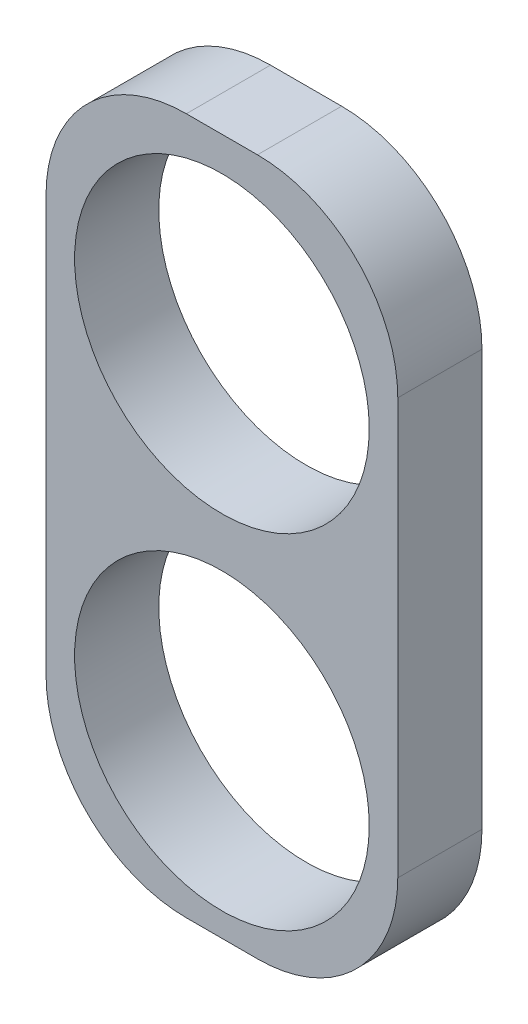
ISO-10303-21;
HEADER;
FILE_DESCRIPTION(('STEP AP214'),'2;1');
FILE_NAME('part.step','',(''),(''),'','','');
FILE_SCHEMA(('AUTOMOTIVE_DESIGN { 1 0 10303 214 1 1 1 1 }'));
ENDSEC;
DATA;
#1=APPLICATION_CONTEXT('core data for automotive mechanical design processes');
#2=APPLICATION_PROTOCOL_DEFINITION('international standard','automotive_design',2000,#1);
#3=PRODUCT_CONTEXT('',#1,'mechanical');
#4=PRODUCT('Part','Part','',(#3));
#5=PRODUCT_RELATED_PRODUCT_CATEGORY('part','',(#4));
#6=PRODUCT_DEFINITION_FORMATION('','',#4);
#7=PRODUCT_DEFINITION_CONTEXT('part definition',#1,'design');
#8=PRODUCT_DEFINITION('design','',#6,#7);
#9=PRODUCT_DEFINITION_SHAPE('','',#8);
#10=(LENGTH_UNIT() NAMED_UNIT(*) SI_UNIT(.MILLI.,.METRE.));
#11=(NAMED_UNIT(*) PLANE_ANGLE_UNIT() SI_UNIT($,.RADIAN.));
#12=(NAMED_UNIT(*) SI_UNIT($,.STERADIAN.) SOLID_ANGLE_UNIT());
#13=UNCERTAINTY_MEASURE_WITH_UNIT(LENGTH_MEASURE(1.E-05),#10,'distance_accuracy_value','');
#14=(GEOMETRIC_REPRESENTATION_CONTEXT(3) GLOBAL_UNCERTAINTY_ASSIGNED_CONTEXT((#13)) GLOBAL_UNIT_ASSIGNED_CONTEXT((#10,
#11,#12)) REPRESENTATION_CONTEXT('',''));
#15=CARTESIAN_POINT('',(0.,0.,0.));
#16=DIRECTION('',(0.,0.,1.));
#17=DIRECTION('',(1.,0.,0.));
#18=AXIS2_PLACEMENT_3D('',#15,#16,#17);
#19=CARTESIAN_POINT('',(0.,0.,1.2));
#20=DIRECTION('',(0.,0.,-1.));
#21=DIRECTION('',(-1.,0.,0.));
#22=AXIS2_PLACEMENT_3D('',#19,#20,#21);
#23=PLANE('',#22);
#24=DIRECTION('',(1.,0.,0.));
#25=VECTOR('',#24,1.);
#26=CARTESIAN_POINT('',(-2.50689281618218,-4.96326867727692,1.2));
#27=LINE('',#26,#25);
#28=CARTESIAN_POINT('',(-0.506892816182179,-4.96326867727692,1.2));
#29=VERTEX_POINT('',#28);
#30=CARTESIAN_POINT('',(0.50689281618218,-4.96326867727692,1.2));
#31=VERTEX_POINT('',#30);
#32=EDGE_CURVE('E139',#29,#31,#27,.T.);
#33=ORIENTED_EDGE('',*,*,#32,.T.);
#34=CARTESIAN_POINT('',(0.50689281618218,-2.96326867727692,1.2));
#35=DIRECTION('',(0.,0.,-1.));
#36=DIRECTION('',(-1.,0.,0.));
#37=AXIS2_PLACEMENT_3D('',#34,#35,#36);
#38=CIRCLE('',#37,2.);
#39=CARTESIAN_POINT('',(2.50689281618218,-2.96326867727692,1.2));
#40=VERTEX_POINT('',#39);
#41=EDGE_CURVE('E158',#31,#40,#38,.F.);
#42=ORIENTED_EDGE('',*,*,#41,.T.);
#43=DIRECTION('',(0.,1.,0.));
#44=VECTOR('',#43,1.);
#45=CARTESIAN_POINT('',(2.50689281618218,-4.96326867727692,1.2));
#46=LINE('',#45,#44);
#47=CARTESIAN_POINT('',(2.50689281618218,2.96326867727692,1.2));
#48=VERTEX_POINT('',#47);
#49=EDGE_CURVE('E122',#40,#48,#46,.T.);
#50=ORIENTED_EDGE('',*,*,#49,.T.);
#51=CARTESIAN_POINT('',(0.506892816182179,2.96326867727692,1.2));
#52=DIRECTION('',(0.,0.,-1.));
#53=DIRECTION('',(-1.,0.,0.));
#54=AXIS2_PLACEMENT_3D('',#51,#52,#53);
#55=CIRCLE('',#54,2.);
#56=CARTESIAN_POINT('',(0.506892816182179,4.96326867727692,1.2));
#57=VERTEX_POINT('',#56);
#58=EDGE_CURVE('E153',#48,#57,#55,.F.);
#59=ORIENTED_EDGE('',*,*,#58,.T.);
#60=DIRECTION('',(-1.,0.,0.));
#61=VECTOR('',#60,1.);
#62=CARTESIAN_POINT('',(-2.50689281618218,4.96326867727692,1.2));
#63=LINE('',#62,#61);
#64=CARTESIAN_POINT('',(-0.506892816182179,4.96326867727692,1.2));
#65=VERTEX_POINT('',#64);
#66=EDGE_CURVE('E169',#57,#65,#63,.T.);
#67=ORIENTED_EDGE('',*,*,#66,.T.);
#68=CARTESIAN_POINT('',(-0.506892816182179,2.96326867727692,1.2));
#69=DIRECTION('',(0.,0.,-1.));
#70=DIRECTION('',(-1.,0.,0.));
#71=AXIS2_PLACEMENT_3D('',#68,#69,#70);
#72=CIRCLE('',#71,2.);
#73=CARTESIAN_POINT('',(-2.50689281618218,2.96326867727692,1.2));
#74=VERTEX_POINT('',#73);
#75=EDGE_CURVE('E58',#65,#74,#72,.F.);
#76=ORIENTED_EDGE('',*,*,#75,.T.);
#77=DIRECTION('',(0.,-1.,0.));
#78=VECTOR('',#77,1.);
#79=CARTESIAN_POINT('',(-2.50689281618218,-4.96326867727692,1.2));
#80=LINE('',#79,#78);
#81=CARTESIAN_POINT('',(-2.50689281618218,-2.96326867727692,1.2));
#82=VERTEX_POINT('',#81);
#83=EDGE_CURVE('E177',#74,#82,#80,.T.);
#84=ORIENTED_EDGE('',*,*,#83,.T.);
#85=CARTESIAN_POINT('',(-0.506892816182179,-2.96326867727692,1.2));
#86=DIRECTION('',(0.,0.,-1.));
#87=DIRECTION('',(-1.,0.,0.));
#88=AXIS2_PLACEMENT_3D('',#85,#86,#87);
#89=CIRCLE('',#88,2.);
#90=EDGE_CURVE('E156',#82,#29,#89,.F.);
#91=ORIENTED_EDGE('',*,*,#90,.T.);
#92=EDGE_LOOP('',(#33,#42,#50,#59,#67,#76,#84,#91));
#93=FACE_BOUND('',#92,.T.);
#94=CARTESIAN_POINT('',(0.,2.37807968431492,1.2));
#95=DIRECTION('',(0.,0.,1.));
#96=DIRECTION('',(1.,0.,0.));
#97=AXIS2_PLACEMENT_3D('',#94,#95,#96);
#98=CIRCLE('',#97,2.1);
#99=CARTESIAN_POINT('',(2.1,2.37807968431492,1.2));
#100=VERTEX_POINT('',#99);
#101=EDGE_CURVE('E130',#100,#100,#98,.T.);
#102=ORIENTED_EDGE('',*,*,#101,.F.);
#103=EDGE_LOOP('',(#102));
#104=FACE_BOUND('',#103,.T.);
#105=CARTESIAN_POINT('',(0.,-2.52414688003544,1.2));
#106=DIRECTION('',(0.,0.,1.));
#107=DIRECTION('',(1.,0.,0.));
#108=AXIS2_PLACEMENT_3D('',#105,#106,#107);
#109=CIRCLE('',#108,2.1);
#110=CARTESIAN_POINT('',(2.1,-2.52414688003544,1.2));
#111=VERTEX_POINT('',#110);
#112=EDGE_CURVE('E184',#111,#111,#109,.T.);
#113=ORIENTED_EDGE('',*,*,#112,.F.);
#114=EDGE_LOOP('',(#113));
#115=FACE_BOUND('',#114,.T.);
#116=ADVANCED_FACE('F36',(#93,#104,#115),#23,.F.);
#117=CARTESIAN_POINT('',(0.,0.,0.));
#118=DIRECTION('',(0.,0.,-1.));
#119=DIRECTION('',(-1.,0.,0.));
#120=AXIS2_PLACEMENT_3D('',#117,#118,#119);
#121=PLANE('',#120);
#122=CARTESIAN_POINT('',(0.,2.37807968431492,0.));
#123=DIRECTION('',(0.,0.,1.));
#124=DIRECTION('',(1.,0.,0.));
#125=AXIS2_PLACEMENT_3D('',#122,#123,#124);
#126=CIRCLE('',#125,2.1);
#127=CARTESIAN_POINT('',(2.1,2.37807968431492,0.));
#128=VERTEX_POINT('',#127);
#129=EDGE_CURVE('E136',#128,#128,#126,.T.);
#130=ORIENTED_EDGE('',*,*,#129,.T.);
#131=EDGE_LOOP('',(#130));
#132=FACE_BOUND('',#131,.T.);
#133=DIRECTION('',(0.,1.,0.));
#134=VECTOR('',#133,1.);
#135=CARTESIAN_POINT('',(2.50689281618218,-4.96326867727692,0.));
#136=LINE('',#135,#134);
#137=CARTESIAN_POINT('',(2.50689281618218,-2.96326867727692,0.));
#138=VERTEX_POINT('',#137);
#139=CARTESIAN_POINT('',(2.50689281618218,2.96326867727692,0.));
#140=VERTEX_POINT('',#139);
#141=EDGE_CURVE('E119',#138,#140,#136,.T.);
#142=ORIENTED_EDGE('',*,*,#141,.F.);
#143=CARTESIAN_POINT('',(0.50689281618218,-2.96326867727692,0.));
#144=DIRECTION('',(0.,0.,-1.));
#145=DIRECTION('',(-1.,0.,0.));
#146=AXIS2_PLACEMENT_3D('',#143,#144,#145);
#147=CIRCLE('',#146,2.);
#148=CARTESIAN_POINT('',(0.50689281618218,-4.96326867727692,0.));
#149=VERTEX_POINT('',#148);
#150=EDGE_CURVE('E102',#138,#149,#147,.T.);
#151=ORIENTED_EDGE('',*,*,#150,.T.);
#152=DIRECTION('',(1.,0.,0.));
#153=VECTOR('',#152,1.);
#154=CARTESIAN_POINT('',(-2.50689281618218,-4.96326867727692,0.));
#155=LINE('',#154,#153);
#156=CARTESIAN_POINT('',(-0.506892816182179,-4.96326867727692,0.));
#157=VERTEX_POINT('',#156);
#158=EDGE_CURVE('E143',#157,#149,#155,.T.);
#159=ORIENTED_EDGE('',*,*,#158,.F.);
#160=CARTESIAN_POINT('',(-0.506892816182179,-2.96326867727692,0.));
#161=DIRECTION('',(0.,0.,-1.));
#162=DIRECTION('',(-1.,0.,0.));
#163=AXIS2_PLACEMENT_3D('',#160,#161,#162);
#164=CIRCLE('',#163,2.);
#165=CARTESIAN_POINT('',(-2.50689281618218,-2.96326867727692,0.));
#166=VERTEX_POINT('',#165);
#167=EDGE_CURVE('E113',#157,#166,#164,.T.);
#168=ORIENTED_EDGE('',*,*,#167,.T.);
#169=DIRECTION('',(0.,-1.,0.));
#170=VECTOR('',#169,1.);
#171=CARTESIAN_POINT('',(-2.50689281618218,-4.96326867727692,0.));
#172=LINE('',#171,#170);
#173=CARTESIAN_POINT('',(-2.50689281618218,2.96326867727692,0.));
#174=VERTEX_POINT('',#173);
#175=EDGE_CURVE('E133',#174,#166,#172,.T.);
#176=ORIENTED_EDGE('',*,*,#175,.F.);
#177=CARTESIAN_POINT('',(-0.506892816182179,2.96326867727692,0.));
#178=DIRECTION('',(0.,0.,-1.));
#179=DIRECTION('',(-1.,0.,0.));
#180=AXIS2_PLACEMENT_3D('',#177,#178,#179);
#181=CIRCLE('',#180,2.);
#182=CARTESIAN_POINT('',(-0.506892816182179,4.96326867727692,0.));
#183=VERTEX_POINT('',#182);
#184=EDGE_CURVE('E147',#174,#183,#181,.T.);
#185=ORIENTED_EDGE('',*,*,#184,.T.);
#186=DIRECTION('',(-1.,0.,0.));
#187=VECTOR('',#186,1.);
#188=CARTESIAN_POINT('',(-2.50689281618218,4.96326867727692,0.));
#189=LINE('',#188,#187);
#190=CARTESIAN_POINT('',(0.506892816182179,4.96326867727692,0.));
#191=VERTEX_POINT('',#190);
#192=EDGE_CURVE('E129',#191,#183,#189,.T.);
#193=ORIENTED_EDGE('',*,*,#192,.F.);
#194=CARTESIAN_POINT('',(0.506892816182179,2.96326867727692,0.));
#195=DIRECTION('',(0.,0.,-1.));
#196=DIRECTION('',(-1.,0.,0.));
#197=AXIS2_PLACEMENT_3D('',#194,#195,#196);
#198=CIRCLE('',#197,2.);
#199=EDGE_CURVE('E123',#191,#140,#198,.T.);
#200=ORIENTED_EDGE('',*,*,#199,.T.);
#201=EDGE_LOOP('',(#142,#151,#159,#168,#176,#185,#193,#200));
#202=FACE_BOUND('',#201,.T.);
#203=CARTESIAN_POINT('',(0.,-2.52414688003544,0.));
#204=DIRECTION('',(0.,0.,1.));
#205=DIRECTION('',(1.,0.,0.));
#206=AXIS2_PLACEMENT_3D('',#203,#204,#205);
#207=CIRCLE('',#206,2.1);
#208=CARTESIAN_POINT('',(2.1,-2.52414688003544,0.));
#209=VERTEX_POINT('',#208);
#210=EDGE_CURVE('E186',#209,#209,#207,.T.);
#211=ORIENTED_EDGE('',*,*,#210,.T.);
#212=EDGE_LOOP('',(#211));
#213=FACE_BOUND('',#212,.T.);
#214=ADVANCED_FACE('F126',(#132,#202,#213),#121,.T.);
#215=CARTESIAN_POINT('',(2.50689281618218,-4.96326867727692,1.2));
#216=DIRECTION('',(-1.,0.,0.));
#217=DIRECTION('',(0.,-1.,0.));
#218=AXIS2_PLACEMENT_3D('',#215,#216,#217);
#219=PLANE('',#218);
#220=ORIENTED_EDGE('',*,*,#49,.F.);
#221=DIRECTION('',(0.,0.,-1.));
#222=VECTOR('',#221,1.);
#223=CARTESIAN_POINT('',(2.50689281618218,-2.96326867727692,1.2));
#224=LINE('',#223,#222);
#225=EDGE_CURVE('E106',#40,#138,#224,.T.);
#226=ORIENTED_EDGE('',*,*,#225,.T.);
#227=ORIENTED_EDGE('',*,*,#141,.T.);
#228=DIRECTION('',(0.,0.,-1.));
#229=VECTOR('',#228,1.);
#230=CARTESIAN_POINT('',(2.50689281618218,2.96326867727692,1.2));
#231=LINE('',#230,#229);
#232=EDGE_CURVE('E124',#140,#48,#231,.F.);
#233=ORIENTED_EDGE('',*,*,#232,.T.);
#234=EDGE_LOOP('',(#220,#226,#227,#233));
#235=FACE_BOUND('',#234,.T.);
#236=ADVANCED_FACE('F118',(#235),#219,.F.);
#237=CARTESIAN_POINT('',(-2.50689281618218,4.96326867727692,1.2));
#238=DIRECTION('',(0.,-1.,0.));
#239=DIRECTION('',(0.,0.,-1.));
#240=AXIS2_PLACEMENT_3D('',#237,#238,#239);
#241=PLANE('',#240);
#242=ORIENTED_EDGE('',*,*,#192,.T.);
#243=DIRECTION('',(0.,0.,-1.));
#244=VECTOR('',#243,1.);
#245=CARTESIAN_POINT('',(-0.506892816182179,4.96326867727692,1.2));
#246=LINE('',#245,#244);
#247=EDGE_CURVE('E11',#183,#65,#246,.F.);
#248=ORIENTED_EDGE('',*,*,#247,.T.);
#249=ORIENTED_EDGE('',*,*,#66,.F.);
#250=DIRECTION('',(0.,0.,-1.));
#251=VECTOR('',#250,1.);
#252=CARTESIAN_POINT('',(0.506892816182179,4.96326867727692,1.2));
#253=LINE('',#252,#251);
#254=EDGE_CURVE('E44',#57,#191,#253,.T.);
#255=ORIENTED_EDGE('',*,*,#254,.T.);
#256=EDGE_LOOP('',(#242,#248,#249,#255));
#257=FACE_BOUND('',#256,.T.);
#258=ADVANCED_FACE('F167',(#257),#241,.F.);
#259=CARTESIAN_POINT('',(-2.50689281618218,-4.96326867727692,1.2));
#260=DIRECTION('',(1.,0.,0.));
#261=DIRECTION('',(0.,1.,0.));
#262=AXIS2_PLACEMENT_3D('',#259,#260,#261);
#263=PLANE('',#262);
#264=ORIENTED_EDGE('',*,*,#175,.T.);
#265=DIRECTION('',(0.,0.,-1.));
#266=VECTOR('',#265,1.);
#267=CARTESIAN_POINT('',(-2.50689281618218,-2.96326867727692,1.2));
#268=LINE('',#267,#266);
#269=EDGE_CURVE('E51',#166,#82,#268,.F.);
#270=ORIENTED_EDGE('',*,*,#269,.T.);
#271=ORIENTED_EDGE('',*,*,#83,.F.);
#272=DIRECTION('',(0.,0.,-1.));
#273=VECTOR('',#272,1.);
#274=CARTESIAN_POINT('',(-2.50689281618218,2.96326867727692,1.2));
#275=LINE('',#274,#273);
#276=EDGE_CURVE('E160',#74,#174,#275,.T.);
#277=ORIENTED_EDGE('',*,*,#276,.T.);
#278=EDGE_LOOP('',(#264,#270,#271,#277));
#279=FACE_BOUND('',#278,.T.);
#280=ADVANCED_FACE('F176',(#279),#263,.F.);
#281=CARTESIAN_POINT('',(-2.50689281618218,-4.96326867727692,1.2));
#282=DIRECTION('',(0.,1.,0.));
#283=DIRECTION('',(0.,0.,1.));
#284=AXIS2_PLACEMENT_3D('',#281,#282,#283);
#285=PLANE('',#284);
#286=ORIENTED_EDGE('',*,*,#158,.T.);
#287=DIRECTION('',(0.,0.,-1.));
#288=VECTOR('',#287,1.);
#289=CARTESIAN_POINT('',(0.50689281618218,-4.96326867727692,1.2));
#290=LINE('',#289,#288);
#291=EDGE_CURVE('E107',#149,#31,#290,.F.);
#292=ORIENTED_EDGE('',*,*,#291,.T.);
#293=ORIENTED_EDGE('',*,*,#32,.F.);
#294=DIRECTION('',(0.,0.,-1.));
#295=VECTOR('',#294,1.);
#296=CARTESIAN_POINT('',(-0.506892816182179,-4.96326867727692,1.2));
#297=LINE('',#296,#295);
#298=EDGE_CURVE('E112',#29,#157,#297,.T.);
#299=ORIENTED_EDGE('',*,*,#298,.T.);
#300=EDGE_LOOP('',(#286,#292,#293,#299));
#301=FACE_BOUND('',#300,.T.);
#302=ADVANCED_FACE('F207',(#301),#285,.F.);
#303=CARTESIAN_POINT('',(0.,2.37807968431492,1.2));
#304=DIRECTION('',(0.,0.,-1.));
#305=DIRECTION('',(-1.,0.,0.));
#306=AXIS2_PLACEMENT_3D('',#303,#304,#305);
#307=CYLINDRICAL_SURFACE('',#306,2.1);
#308=ORIENTED_EDGE('',*,*,#101,.T.);
#309=EDGE_LOOP('',(#308));
#310=FACE_BOUND('',#309,.T.);
#311=ORIENTED_EDGE('',*,*,#129,.F.);
#312=EDGE_LOOP('',(#311));
#313=FACE_BOUND('',#312,.T.);
#314=ADVANCED_FACE('F204',(#310,#313),#307,.F.);
#315=CARTESIAN_POINT('',(0.,-2.52414688003544,1.2));
#316=DIRECTION('',(0.,0.,-1.));
#317=DIRECTION('',(-1.,0.,0.));
#318=AXIS2_PLACEMENT_3D('',#315,#316,#317);
#319=CYLINDRICAL_SURFACE('',#318,2.1);
#320=ORIENTED_EDGE('',*,*,#112,.T.);
#321=EDGE_LOOP('',(#320));
#322=FACE_BOUND('',#321,.T.);
#323=ORIENTED_EDGE('',*,*,#210,.F.);
#324=EDGE_LOOP('',(#323));
#325=FACE_BOUND('',#324,.T.);
#326=ADVANCED_FACE('F192',(#322,#325),#319,.F.);
#327=CARTESIAN_POINT('',(0.50689281618218,-2.96326867727692,1.2));
#328=DIRECTION('',(0.,0.,-1.));
#329=DIRECTION('',(-1.,0.,0.));
#330=AXIS2_PLACEMENT_3D('',#327,#328,#329);
#331=CYLINDRICAL_SURFACE('',#330,2.);
#332=ORIENTED_EDGE('',*,*,#41,.F.);
#333=ORIENTED_EDGE('',*,*,#291,.F.);
#334=ORIENTED_EDGE('',*,*,#150,.F.);
#335=ORIENTED_EDGE('',*,*,#225,.F.);
#336=EDGE_LOOP('',(#332,#333,#334,#335));
#337=FACE_BOUND('',#336,.T.);
#338=ADVANCED_FACE('F105',(#337),#331,.T.);
#339=CARTESIAN_POINT('',(-0.506892816182179,-2.96326867727692,1.2));
#340=DIRECTION('',(0.,0.,-1.));
#341=DIRECTION('',(-1.,0.,0.));
#342=AXIS2_PLACEMENT_3D('',#339,#340,#341);
#343=CYLINDRICAL_SURFACE('',#342,2.);
#344=ORIENTED_EDGE('',*,*,#90,.F.);
#345=ORIENTED_EDGE('',*,*,#269,.F.);
#346=ORIENTED_EDGE('',*,*,#167,.F.);
#347=ORIENTED_EDGE('',*,*,#298,.F.);
#348=EDGE_LOOP('',(#344,#345,#346,#347));
#349=FACE_BOUND('',#348,.T.);
#350=ADVANCED_FACE('F219',(#349),#343,.T.);
#351=CARTESIAN_POINT('',(-0.506892816182179,2.96326867727692,1.2));
#352=DIRECTION('',(0.,0.,-1.));
#353=DIRECTION('',(-1.,0.,0.));
#354=AXIS2_PLACEMENT_3D('',#351,#352,#353);
#355=CYLINDRICAL_SURFACE('',#354,2.);
#356=ORIENTED_EDGE('',*,*,#75,.F.);
#357=ORIENTED_EDGE('',*,*,#247,.F.);
#358=ORIENTED_EDGE('',*,*,#184,.F.);
#359=ORIENTED_EDGE('',*,*,#276,.F.);
#360=EDGE_LOOP('',(#356,#357,#358,#359));
#361=FACE_BOUND('',#360,.T.);
#362=ADVANCED_FACE('F175',(#361),#355,.T.);
#363=CARTESIAN_POINT('',(0.506892816182179,2.96326867727692,1.2));
#364=DIRECTION('',(0.,0.,-1.));
#365=DIRECTION('',(-1.,0.,0.));
#366=AXIS2_PLACEMENT_3D('',#363,#364,#365);
#367=CYLINDRICAL_SURFACE('',#366,2.);
#368=ORIENTED_EDGE('',*,*,#58,.F.);
#369=ORIENTED_EDGE('',*,*,#232,.F.);
#370=ORIENTED_EDGE('',*,*,#199,.F.);
#371=ORIENTED_EDGE('',*,*,#254,.F.);
#372=EDGE_LOOP('',(#368,#369,#370,#371));
#373=FACE_BOUND('',#372,.T.);
#374=ADVANCED_FACE('F38',(#373),#367,.T.);
#375=CLOSED_SHELL('',(#116,#214,#236,#258,#280,#302,#314,#326,#338,#350,#362,#374));
#376=MANIFOLD_SOLID_BREP('B2',#375);
#377=ADVANCED_BREP_SHAPE_REPRESENTATION('',(#18,#376),#14);
#378=SHAPE_DEFINITION_REPRESENTATION(#9,#377);
ENDSEC;
END-ISO-10303-21;
